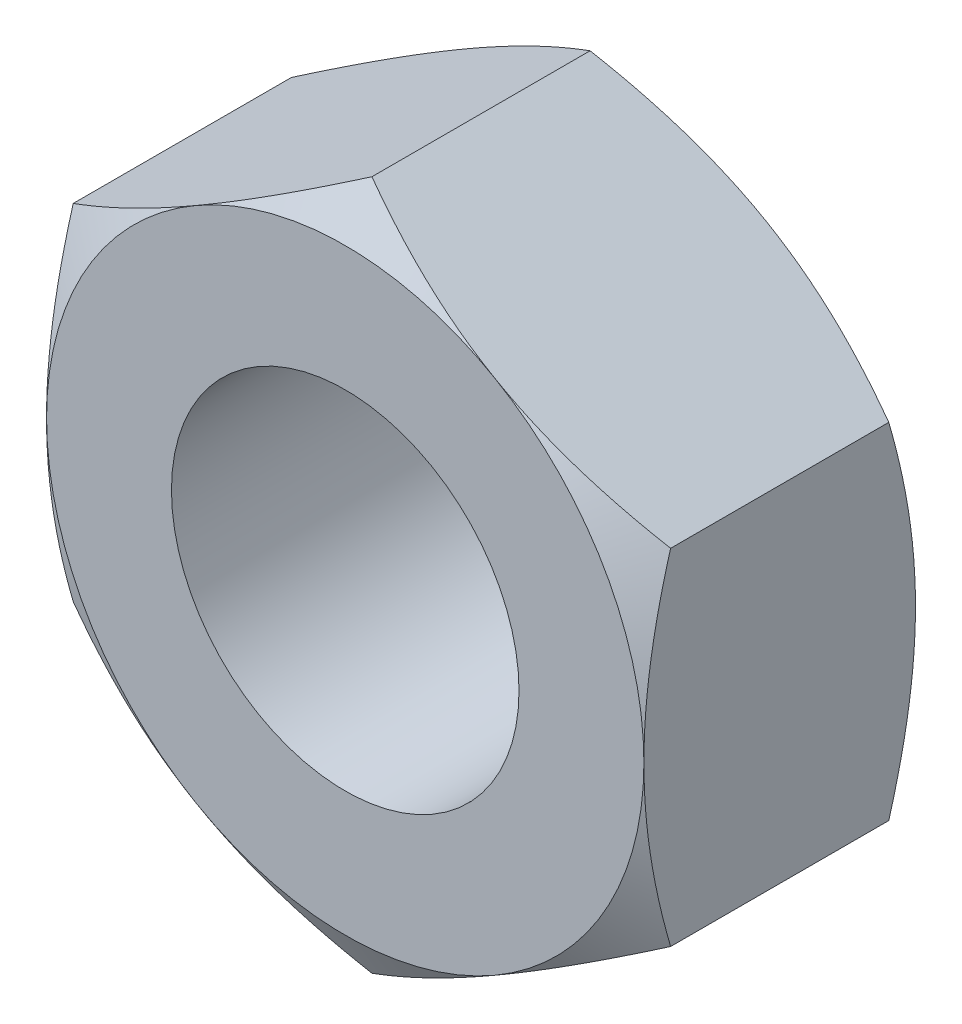
ISO-10303-21;
HEADER;
FILE_DESCRIPTION(('STEP AP214'),'2;1');
FILE_NAME('part.step','',(''),(''),'','','');
FILE_SCHEMA(('AUTOMOTIVE_DESIGN { 1 0 10303 214 1 1 1 1 }'));
ENDSEC;
DATA;
#1=APPLICATION_CONTEXT('core data for automotive mechanical design processes');
#2=APPLICATION_PROTOCOL_DEFINITION('international standard','automotive_design',2000,#1);
#3=PRODUCT_CONTEXT('',#1,'mechanical');
#4=PRODUCT('Part','Part','',(#3));
#5=PRODUCT_RELATED_PRODUCT_CATEGORY('part','',(#4));
#6=PRODUCT_DEFINITION_FORMATION('','',#4);
#7=PRODUCT_DEFINITION_CONTEXT('part definition',#1,'design');
#8=PRODUCT_DEFINITION('design','',#6,#7);
#9=PRODUCT_DEFINITION_SHAPE('','',#8);
#10=(LENGTH_UNIT() NAMED_UNIT(*) SI_UNIT(.MILLI.,.METRE.));
#11=(NAMED_UNIT(*) PLANE_ANGLE_UNIT() SI_UNIT($,.RADIAN.));
#12=(NAMED_UNIT(*) SI_UNIT($,.STERADIAN.) SOLID_ANGLE_UNIT());
#13=UNCERTAINTY_MEASURE_WITH_UNIT(LENGTH_MEASURE(1.E-05),#10,'distance_accuracy_value','');
#14=(GEOMETRIC_REPRESENTATION_CONTEXT(3) GLOBAL_UNCERTAINTY_ASSIGNED_CONTEXT((#13)) GLOBAL_UNIT_ASSIGNED_CONTEXT((#10,
#11,#12)) REPRESENTATION_CONTEXT('',''));
#15=CARTESIAN_POINT('',(0.,0.,0.));
#16=DIRECTION('',(0.,0.,1.));
#17=DIRECTION('',(1.,0.,0.));
#18=AXIS2_PLACEMENT_3D('',#15,#16,#17);
#19=CARTESIAN_POINT('',(0.,0.,0.));
#20=DIRECTION('',(0.,0.,1.));
#21=DIRECTION('',(1.,0.,0.));
#22=AXIS2_PLACEMENT_3D('',#19,#20,#21);
#23=PLANE('',#22);
#24=CARTESIAN_POINT('',(0.,0.,0.));
#25=DIRECTION('',(0.,0.,1.));
#26=DIRECTION('',(1.,0.,0.));
#27=AXIS2_PLACEMENT_3D('',#24,#25,#26);
#28=CIRCLE('',#27,1.6);
#29=CARTESIAN_POINT('',(1.6,0.,0.));
#30=VERTEX_POINT('',#29);
#31=EDGE_CURVE('E445',#30,#30,#28,.T.);
#32=ORIENTED_EDGE('',*,*,#31,.T.);
#33=EDGE_LOOP('',(#32));
#34=FACE_BOUND('',#33,.T.);
#35=CARTESIAN_POINT('',(0.,0.,0.));
#36=DIRECTION('',(0.,0.,-1.));
#37=DIRECTION('',(-1.,0.,0.));
#38=AXIS2_PLACEMENT_3D('',#35,#36,#37);
#39=CIRCLE('',#38,2.75);
#40=CARTESIAN_POINT('',(2.75,0.,0.));
#41=VERTEX_POINT('',#40);
#42=CARTESIAN_POINT('',(1.375,-2.38156986040721,0.));
#43=VERTEX_POINT('',#42);
#44=EDGE_CURVE('E169',#41,#43,#39,.T.);
#45=ORIENTED_EDGE('',*,*,#44,.T.);
#46=CARTESIAN_POINT('',(0.,0.,0.));
#47=DIRECTION('',(0.,0.,-1.));
#48=DIRECTION('',(-1.,0.,0.));
#49=AXIS2_PLACEMENT_3D('',#46,#47,#48);
#50=CIRCLE('',#49,2.75);
#51=CARTESIAN_POINT('',(-1.375,-2.38156986040721,0.));
#52=VERTEX_POINT('',#51);
#53=EDGE_CURVE('E171',#43,#52,#50,.T.);
#54=ORIENTED_EDGE('',*,*,#53,.T.);
#55=CARTESIAN_POINT('',(0.,0.,0.));
#56=DIRECTION('',(0.,0.,-1.));
#57=DIRECTION('',(-1.,0.,0.));
#58=AXIS2_PLACEMENT_3D('',#55,#56,#57);
#59=CIRCLE('',#58,2.75);
#60=CARTESIAN_POINT('',(-2.75,0.,0.));
#61=VERTEX_POINT('',#60);
#62=EDGE_CURVE('E56',#52,#61,#59,.T.);
#63=ORIENTED_EDGE('',*,*,#62,.T.);
#64=CARTESIAN_POINT('',(0.,0.,0.));
#65=DIRECTION('',(0.,0.,-1.));
#66=DIRECTION('',(-1.,0.,0.));
#67=AXIS2_PLACEMENT_3D('',#64,#65,#66);
#68=CIRCLE('',#67,2.75);
#69=CARTESIAN_POINT('',(-1.375,2.38156986040721,0.));
#70=VERTEX_POINT('',#69);
#71=EDGE_CURVE('E250',#61,#70,#68,.T.);
#72=ORIENTED_EDGE('',*,*,#71,.T.);
#73=CARTESIAN_POINT('',(0.,0.,0.));
#74=DIRECTION('',(0.,0.,-1.));
#75=DIRECTION('',(-1.,0.,0.));
#76=AXIS2_PLACEMENT_3D('',#73,#74,#75);
#77=CIRCLE('',#76,2.75);
#78=CARTESIAN_POINT('',(1.375,2.38156986040721,0.));
#79=VERTEX_POINT('',#78);
#80=EDGE_CURVE('E244',#70,#79,#77,.T.);
#81=ORIENTED_EDGE('',*,*,#80,.T.);
#82=CARTESIAN_POINT('',(0.,0.,0.));
#83=DIRECTION('',(0.,0.,-1.));
#84=DIRECTION('',(-1.,0.,0.));
#85=AXIS2_PLACEMENT_3D('',#82,#83,#84);
#86=CIRCLE('',#85,2.75);
#87=EDGE_CURVE('E173',#79,#41,#86,.T.);
#88=ORIENTED_EDGE('',*,*,#87,.T.);
#89=EDGE_LOOP('',(#45,#54,#63,#72,#81,#88));
#90=FACE_BOUND('',#89,.T.);
#91=ADVANCED_FACE('F53',(#34,#90),#23,.F.);
#92=CARTESIAN_POINT('',(2.75,1.58771324027147,0.));
#93=DIRECTION('',(0.5,0.866025403784439,0.));
#94=DIRECTION('',(0.,0.,-1.));
#95=AXIS2_PLACEMENT_3D('',#92,#93,#94);
#96=PLANE('',#95);
#97=DIRECTION('',(0.,0.,-1.));
#98=VECTOR('',#97,1.);
#99=CARTESIAN_POINT('',(2.75,1.58771324027147,2.5));
#100=LINE('',#99,#98);
#101=CARTESIAN_POINT('',(2.75,1.58771324027147,2.25437990693814));
#102=VERTEX_POINT('',#101);
#103=CARTESIAN_POINT('',(2.75,1.58771324027147,0.245620093061863));
#104=VERTEX_POINT('',#103);
#105=EDGE_CURVE('E207',#102,#104,#100,.T.);
#106=ORIENTED_EDGE('',*,*,#105,.T.);
#107=CARTESIAN_POINT('',(2.75,1.58771324027147,0.245620093061863));
#108=CARTESIAN_POINT('',(2.01313972081441,2.01313972081441,0.));
#109=CARTESIAN_POINT('',(1.375,2.38156986040721,0.));
#110=(BOUNDED_CURVE() B_SPLINE_CURVE(2,(#107,#108,#109),.UNSPECIFIED.,.F.,
.F.) B_SPLINE_CURVE_WITH_KNOTS((3,3),(0.0761014663262321,0.248735310295511),
.UNSPECIFIED.) CURVE() GEOMETRIC_REPRESENTATION_ITEM() RATIONAL_B_SPLINE_CURVE((1.03390088978584,
1.05540200962769,1.)) REPRESENTATION_ITEM(''));
#111=EDGE_CURVE('E231',#104,#79,#110,.T.);
#112=ORIENTED_EDGE('',*,*,#111,.T.);
#113=CARTESIAN_POINT('',(1.375,2.38156986040721,0.));
#114=CARTESIAN_POINT('',(0.736860279185589,2.75,0.));
#115=CARTESIAN_POINT('',(0.,3.17542648054294,0.245620093061863));
#116=(BOUNDED_CURVE() B_SPLINE_CURVE(2,(#113,#114,#115),.UNSPECIFIED.,.F.,
.F.) B_SPLINE_CURVE_WITH_KNOTS((3,3),(0.248735310295511,0.42136915426479),
.UNSPECIFIED.) CURVE() GEOMETRIC_REPRESENTATION_ITEM() RATIONAL_B_SPLINE_CURVE((1.,
1.05540200962769,1.03390088978584)) REPRESENTATION_ITEM(''));
#117=CARTESIAN_POINT('',(0.,3.17542648054294,0.245620093061863));
#118=VERTEX_POINT('',#117);
#119=EDGE_CURVE('E243',#79,#118,#116,.T.);
#120=ORIENTED_EDGE('',*,*,#119,.T.);
#121=DIRECTION('',(0.,0.,1.));
#122=VECTOR('',#121,1.);
#123=CARTESIAN_POINT('',(0.,3.17542648054294,0.));
#124=LINE('',#123,#122);
#125=CARTESIAN_POINT('',(0.,3.17542648054294,2.25437990693814));
#126=VERTEX_POINT('',#125);
#127=EDGE_CURVE('E11',#118,#126,#124,.T.);
#128=ORIENTED_EDGE('',*,*,#127,.T.);
#129=CARTESIAN_POINT('',(1.375,2.38156986040721,2.5));
#130=CARTESIAN_POINT('',(0.736860279185589,2.75,2.5));
#131=CARTESIAN_POINT('',(0.,3.17542648054294,2.25437990693814));
#132=(BOUNDED_CURVE() B_SPLINE_CURVE(2,(#129,#130,#131),.UNSPECIFIED.,.F.,
.F.) B_SPLINE_CURVE_WITH_KNOTS((3,3),(0.248735310295511,0.42136915426479),
.UNSPECIFIED.) CURVE() GEOMETRIC_REPRESENTATION_ITEM() RATIONAL_B_SPLINE_CURVE((1.,
1.05540200962769,1.03390088978584)) REPRESENTATION_ITEM(''));
#133=CARTESIAN_POINT('',(1.375,2.38156986040721,2.5));
#134=VERTEX_POINT('',#133);
#135=EDGE_CURVE('E286',#134,#126,#132,.T.);
#136=ORIENTED_EDGE('',*,*,#135,.F.);
#137=CARTESIAN_POINT('',(2.75,1.58771324027147,2.25437990693814));
#138=CARTESIAN_POINT('',(2.01313972081441,2.01313972081441,2.5));
#139=CARTESIAN_POINT('',(1.375,2.38156986040721,2.5));
#140=(BOUNDED_CURVE() B_SPLINE_CURVE(2,(#137,#138,#139),.UNSPECIFIED.,.F.,
.F.) B_SPLINE_CURVE_WITH_KNOTS((3,3),(0.0761014663262321,0.248735310295511),
.UNSPECIFIED.) CURVE() GEOMETRIC_REPRESENTATION_ITEM() RATIONAL_B_SPLINE_CURVE((1.03390088978584,
1.05540200962769,1.)) REPRESENTATION_ITEM(''));
#141=EDGE_CURVE('E333',#102,#134,#140,.T.);
#142=ORIENTED_EDGE('',*,*,#141,.F.);
#143=EDGE_LOOP('',(#106,#112,#120,#128,#136,#142));
#144=FACE_BOUND('',#143,.T.);
#145=ADVANCED_FACE('F485',(#144),#96,.T.);
#146=CARTESIAN_POINT('',(0.,3.17542648054294,0.));
#147=DIRECTION('',(-0.5,0.866025403784439,0.));
#148=DIRECTION('',(0.,0.,1.));
#149=AXIS2_PLACEMENT_3D('',#146,#147,#148);
#150=PLANE('',#149);
#151=ORIENTED_EDGE('',*,*,#127,.F.);
#152=CARTESIAN_POINT('',(0.,3.17542648054294,0.245620093061863));
#153=CARTESIAN_POINT('',(-0.736860279185586,2.75,0.));
#154=CARTESIAN_POINT('',(-1.375,2.38156986040721,0.));
#155=(BOUNDED_CURVE() B_SPLINE_CURVE(2,(#152,#153,#154),.UNSPECIFIED.,.F.,
.F.) B_SPLINE_CURVE_WITH_KNOTS((3,3),(0.0761014663262319,0.248735310295511),
.UNSPECIFIED.) CURVE() GEOMETRIC_REPRESENTATION_ITEM() RATIONAL_B_SPLINE_CURVE((1.03390088978584,
1.05540200962769,1.)) REPRESENTATION_ITEM(''));
#156=EDGE_CURVE('E237',#118,#70,#155,.T.);
#157=ORIENTED_EDGE('',*,*,#156,.T.);
#158=CARTESIAN_POINT('',(-1.375,2.38156986040721,0.));
#159=CARTESIAN_POINT('',(-2.01313972081441,2.01313972081441,0.));
#160=CARTESIAN_POINT('',(-2.75,1.58771324027147,0.245620093061863));
#161=(BOUNDED_CURVE() B_SPLINE_CURVE(2,(#158,#159,#160),.UNSPECIFIED.,.F.,
.F.) B_SPLINE_CURVE_WITH_KNOTS((3,3),(0.248735310295511,0.42136915426479),
.UNSPECIFIED.) CURVE() GEOMETRIC_REPRESENTATION_ITEM() RATIONAL_B_SPLINE_CURVE((1.,
1.05540200962769,1.03390088978584)) REPRESENTATION_ITEM(''));
#162=CARTESIAN_POINT('',(-2.75,1.58771324027147,0.245620093061863));
#163=VERTEX_POINT('',#162);
#164=EDGE_CURVE('E253',#70,#163,#161,.T.);
#165=ORIENTED_EDGE('',*,*,#164,.T.);
#166=DIRECTION('',(0.,0.,1.));
#167=VECTOR('',#166,1.);
#168=CARTESIAN_POINT('',(-2.75,1.58771324027147,0.));
#169=LINE('',#168,#167);
#170=CARTESIAN_POINT('',(-2.75,1.58771324027147,2.25437990693814));
#171=VERTEX_POINT('',#170);
#172=EDGE_CURVE('E62',#163,#171,#169,.T.);
#173=ORIENTED_EDGE('',*,*,#172,.T.);
#174=CARTESIAN_POINT('',(-1.375,2.38156986040721,2.5));
#175=CARTESIAN_POINT('',(-2.01313972081441,2.01313972081441,2.5));
#176=CARTESIAN_POINT('',(-2.75,1.58771324027147,2.25437990693814));
#177=(BOUNDED_CURVE() B_SPLINE_CURVE(2,(#174,#175,#176),.UNSPECIFIED.,.F.,
.F.) B_SPLINE_CURVE_WITH_KNOTS((3,3),(0.248735310295511,0.42136915426479),
.UNSPECIFIED.) CURVE() GEOMETRIC_REPRESENTATION_ITEM() RATIONAL_B_SPLINE_CURVE((1.,
1.05540200962769,1.03390088978584)) REPRESENTATION_ITEM(''));
#178=CARTESIAN_POINT('',(-1.375,2.38156986040721,2.5));
#179=VERTEX_POINT('',#178);
#180=EDGE_CURVE('E326',#179,#171,#177,.T.);
#181=ORIENTED_EDGE('',*,*,#180,.F.);
#182=CARTESIAN_POINT('',(0.,3.17542648054294,2.25437990693814));
#183=CARTESIAN_POINT('',(-0.736860279185586,2.75,2.5));
#184=CARTESIAN_POINT('',(-1.375,2.38156986040721,2.5));
#185=(BOUNDED_CURVE() B_SPLINE_CURVE(2,(#182,#183,#184),.UNSPECIFIED.,.F.,
.F.) B_SPLINE_CURVE_WITH_KNOTS((3,3),(0.0761014663262319,0.248735310295511),
.UNSPECIFIED.) CURVE() GEOMETRIC_REPRESENTATION_ITEM() RATIONAL_B_SPLINE_CURVE((1.03390088978584,
1.05540200962769,1.)) REPRESENTATION_ITEM(''));
#186=EDGE_CURVE('E280',#126,#179,#185,.T.);
#187=ORIENTED_EDGE('',*,*,#186,.F.);
#188=EDGE_LOOP('',(#151,#157,#165,#173,#181,#187));
#189=FACE_BOUND('',#188,.T.);
#190=ADVANCED_FACE('F491',(#189),#150,.T.);
#191=CARTESIAN_POINT('',(-2.75,1.58771324027147,0.));
#192=DIRECTION('',(-1.,0.,0.));
#193=DIRECTION('',(0.,0.,1.));
#194=AXIS2_PLACEMENT_3D('',#191,#192,#193);
#195=PLANE('',#194);
#196=ORIENTED_EDGE('',*,*,#172,.F.);
#197=CARTESIAN_POINT('',(-2.75,1.58771324027147,0.245620093061863));
#198=CARTESIAN_POINT('',(-2.75,0.736860279185591,0.));
#199=CARTESIAN_POINT('',(-2.75,0.,0.));
#200=(BOUNDED_CURVE() B_SPLINE_CURVE(2,(#197,#198,#199),.UNSPECIFIED.,.F.,
.F.) B_SPLINE_CURVE_WITH_KNOTS((3,3),(0.076101466326232,0.248735310295511),
.UNSPECIFIED.) CURVE() GEOMETRIC_REPRESENTATION_ITEM() RATIONAL_B_SPLINE_CURVE((1.03390088978584,
1.05540200962769,1.)) REPRESENTATION_ITEM(''));
#201=EDGE_CURVE('E249',#163,#61,#200,.T.);
#202=ORIENTED_EDGE('',*,*,#201,.T.);
#203=CARTESIAN_POINT('',(-2.75,0.,0.));
#204=CARTESIAN_POINT('',(-2.75,-0.736860279185585,0.));
#205=CARTESIAN_POINT('',(-2.75,-1.58771324027147,0.245620093061863));
#206=(BOUNDED_CURVE() B_SPLINE_CURVE(2,(#203,#204,#205),.UNSPECIFIED.,.F.,
.F.) B_SPLINE_CURVE_WITH_KNOTS((3,3),(0.248735310295511,0.42136915426479),
.UNSPECIFIED.) CURVE() GEOMETRIC_REPRESENTATION_ITEM() RATIONAL_B_SPLINE_CURVE((1.,
1.05540200962769,1.03390088978584)) REPRESENTATION_ITEM(''));
#207=CARTESIAN_POINT('',(-2.75,-1.58771324027147,0.245620093061863));
#208=VERTEX_POINT('',#207);
#209=EDGE_CURVE('E252',#61,#208,#206,.T.);
#210=ORIENTED_EDGE('',*,*,#209,.T.);
#211=DIRECTION('',(0.,0.,1.));
#212=VECTOR('',#211,1.);
#213=CARTESIAN_POINT('',(-2.75,-1.58771324027147,0.));
#214=LINE('',#213,#212);
#215=CARTESIAN_POINT('',(-2.75,-1.58771324027147,2.25437990693814));
#216=VERTEX_POINT('',#215);
#217=EDGE_CURVE('E198',#208,#216,#214,.T.);
#218=ORIENTED_EDGE('',*,*,#217,.T.);
#219=CARTESIAN_POINT('',(-2.75,0.,2.5));
#220=CARTESIAN_POINT('',(-2.75,-0.736860279185585,2.5));
#221=CARTESIAN_POINT('',(-2.75,-1.58771324027147,2.25437990693814));
#222=(BOUNDED_CURVE() B_SPLINE_CURVE(2,(#219,#220,#221),.UNSPECIFIED.,.F.,
.F.) B_SPLINE_CURVE_WITH_KNOTS((3,3),(0.248735310295511,0.42136915426479),
.UNSPECIFIED.) CURVE() GEOMETRIC_REPRESENTATION_ITEM() RATIONAL_B_SPLINE_CURVE((1.,
1.05540200962769,1.03390088978584)) REPRESENTATION_ITEM(''));
#223=CARTESIAN_POINT('',(-2.75,0.,2.5));
#224=VERTEX_POINT('',#223);
#225=EDGE_CURVE('E371',#224,#216,#222,.T.);
#226=ORIENTED_EDGE('',*,*,#225,.F.);
#227=CARTESIAN_POINT('',(-2.75,1.58771324027147,2.25437990693814));
#228=CARTESIAN_POINT('',(-2.75,0.736860279185591,2.5));
#229=CARTESIAN_POINT('',(-2.75,0.,2.5));
#230=(BOUNDED_CURVE() B_SPLINE_CURVE(2,(#227,#228,#229),.UNSPECIFIED.,.F.,
.F.) B_SPLINE_CURVE_WITH_KNOTS((3,3),(0.076101466326232,0.248735310295511),
.UNSPECIFIED.) CURVE() GEOMETRIC_REPRESENTATION_ITEM() RATIONAL_B_SPLINE_CURVE((1.03390088978584,
1.05540200962769,1.)) REPRESENTATION_ITEM(''));
#231=EDGE_CURVE('E320',#171,#224,#230,.T.);
#232=ORIENTED_EDGE('',*,*,#231,.F.);
#233=EDGE_LOOP('',(#196,#202,#210,#218,#226,#232));
#234=FACE_BOUND('',#233,.T.);
#235=ADVANCED_FACE('F500',(#234),#195,.T.);
#236=CARTESIAN_POINT('',(0.,0.,0.263594173754417));
#237=DIRECTION('',(0.,0.,1.));
#238=DIRECTION('',(-1.,0.,0.));
#239=AXIS2_PLACEMENT_3D('',#236,#237,#238);
#240=CONICAL_SURFACE('',#239,3.20655850152179,1.0471975511966);
#241=CARTESIAN_POINT('',(1.375,-2.38156986040721,0.));
#242=CARTESIAN_POINT('',(2.01313972081441,-2.01313972081441,0.));
#243=CARTESIAN_POINT('',(2.75,-1.58771324027147,0.245620093061863));
#244=(BOUNDED_CURVE() B_SPLINE_CURVE(2,(#241,#242,#243),.UNSPECIFIED.,.F.,
.F.) B_SPLINE_CURVE_WITH_KNOTS((3,3),(0.248735310295511,0.421369154264791),
.UNSPECIFIED.) CURVE() GEOMETRIC_REPRESENTATION_ITEM() RATIONAL_B_SPLINE_CURVE((1.,
1.05540200962769,1.03390088978584)) REPRESENTATION_ITEM(''));
#245=CARTESIAN_POINT('',(2.75,-1.58771324027147,0.245620093061863));
#246=VERTEX_POINT('',#245);
#247=EDGE_CURVE('E191',#43,#246,#244,.T.);
#248=ORIENTED_EDGE('',*,*,#247,.F.);
#249=ORIENTED_EDGE('',*,*,#44,.F.);
#250=CARTESIAN_POINT('',(2.75,-1.58771324027147,0.245620093061863));
#251=CARTESIAN_POINT('',(2.75,-0.736860279185591,0.));
#252=CARTESIAN_POINT('',(2.75,0.,0.));
#253=(BOUNDED_CURVE() B_SPLINE_CURVE(2,(#250,#251,#252),.UNSPECIFIED.,.F.,
.F.) B_SPLINE_CURVE_WITH_KNOTS((3,3),(0.076101466326232,0.248735310295511),
.UNSPECIFIED.) CURVE() GEOMETRIC_REPRESENTATION_ITEM() RATIONAL_B_SPLINE_CURVE((1.03390088978584,
1.05540200962769,1.)) REPRESENTATION_ITEM(''));
#254=EDGE_CURVE('E194',#246,#41,#253,.T.);
#255=ORIENTED_EDGE('',*,*,#254,.F.);
#256=EDGE_LOOP('',(#248,#249,#255));
#257=FACE_BOUND('',#256,.T.);
#258=ADVANCED_FACE('F192',(#257),#240,.T.);
#259=CARTESIAN_POINT('',(0.,0.,0.263594173754417));
#260=DIRECTION('',(0.,0.,1.));
#261=DIRECTION('',(-1.,0.,0.));
#262=AXIS2_PLACEMENT_3D('',#259,#260,#261);
#263=CONICAL_SURFACE('',#262,3.20655850152179,1.0471975511966);
#264=CARTESIAN_POINT('',(-1.375,-2.38156986040721,0.));
#265=CARTESIAN_POINT('',(-0.736860279185591,-2.75,0.));
#266=CARTESIAN_POINT('',(0.,-3.17542648054294,0.245620093061863));
#267=(BOUNDED_CURVE() B_SPLINE_CURVE(2,(#264,#265,#266),.UNSPECIFIED.,.F.,
.F.) B_SPLINE_CURVE_WITH_KNOTS((3,3),(0.248735310295511,0.42136915426479),
.UNSPECIFIED.) CURVE() GEOMETRIC_REPRESENTATION_ITEM() RATIONAL_B_SPLINE_CURVE((1.,
1.05540200962769,1.03390088978584)) REPRESENTATION_ITEM(''));
#268=CARTESIAN_POINT('',(0.,-3.17542648054294,0.245620093061863));
#269=VERTEX_POINT('',#268);
#270=EDGE_CURVE('E187',#52,#269,#267,.T.);
#271=ORIENTED_EDGE('',*,*,#270,.F.);
#272=ORIENTED_EDGE('',*,*,#53,.F.);
#273=CARTESIAN_POINT('',(0.,-3.17542648054294,0.245620093061863));
#274=CARTESIAN_POINT('',(0.736860279185585,-2.75,0.));
#275=CARTESIAN_POINT('',(1.375,-2.38156986040721,0.));
#276=(BOUNDED_CURVE() B_SPLINE_CURVE(2,(#273,#274,#275),.UNSPECIFIED.,.F.,
.F.) B_SPLINE_CURVE_WITH_KNOTS((3,3),(0.076101466326232,0.248735310295511),
.UNSPECIFIED.) CURVE() GEOMETRIC_REPRESENTATION_ITEM() RATIONAL_B_SPLINE_CURVE((1.03390088978584,
1.05540200962769,1.)) REPRESENTATION_ITEM(''));
#277=EDGE_CURVE('E185',#269,#43,#276,.T.);
#278=ORIENTED_EDGE('',*,*,#277,.F.);
#279=EDGE_LOOP('',(#271,#272,#278));
#280=FACE_BOUND('',#279,.T.);
#281=ADVANCED_FACE('F183',(#280),#263,.T.);
#282=CARTESIAN_POINT('',(0.,0.,0.263594173754417));
#283=DIRECTION('',(0.,0.,1.));
#284=DIRECTION('',(-1.,0.,0.));
#285=AXIS2_PLACEMENT_3D('',#282,#283,#284);
#286=CONICAL_SURFACE('',#285,3.20655850152179,1.0471975511966);
#287=ORIENTED_EDGE('',*,*,#209,.F.);
#288=ORIENTED_EDGE('',*,*,#62,.F.);
#289=CARTESIAN_POINT('',(-2.75,-1.58771324027147,0.245620093061863));
#290=CARTESIAN_POINT('',(-2.01313972081441,-2.01313972081441,0.));
#291=CARTESIAN_POINT('',(-1.375,-2.38156986040721,0.));
#292=(BOUNDED_CURVE() B_SPLINE_CURVE(2,(#289,#290,#291),.UNSPECIFIED.,.F.,
.F.) B_SPLINE_CURVE_WITH_KNOTS((3,3),(0.0761014663262319,0.248735310295511),
.UNSPECIFIED.) CURVE() GEOMETRIC_REPRESENTATION_ITEM() RATIONAL_B_SPLINE_CURVE((1.03390088978584,
1.05540200962769,1.)) REPRESENTATION_ITEM(''));
#293=EDGE_CURVE('E219',#208,#52,#292,.T.);
#294=ORIENTED_EDGE('',*,*,#293,.F.);
#295=EDGE_LOOP('',(#287,#288,#294));
#296=FACE_BOUND('',#295,.T.);
#297=ADVANCED_FACE('F507',(#296),#286,.T.);
#298=CARTESIAN_POINT('',(0.,0.,0.263594173754417));
#299=DIRECTION('',(0.,0.,1.));
#300=DIRECTION('',(-1.,0.,0.));
#301=AXIS2_PLACEMENT_3D('',#298,#299,#300);
#302=CONICAL_SURFACE('',#301,3.20655850152179,1.0471975511966);
#303=ORIENTED_EDGE('',*,*,#201,.F.);
#304=ORIENTED_EDGE('',*,*,#164,.F.);
#305=ORIENTED_EDGE('',*,*,#71,.F.);
#306=EDGE_LOOP('',(#303,#304,#305));
#307=FACE_BOUND('',#306,.T.);
#308=ADVANCED_FACE('F508',(#307),#302,.T.);
#309=CARTESIAN_POINT('',(0.,0.,0.263594173754417));
#310=DIRECTION('',(0.,0.,1.));
#311=DIRECTION('',(-1.,0.,0.));
#312=AXIS2_PLACEMENT_3D('',#309,#310,#311);
#313=CONICAL_SURFACE('',#312,3.20655850152179,1.0471975511966);
#314=ORIENTED_EDGE('',*,*,#156,.F.);
#315=ORIENTED_EDGE('',*,*,#119,.F.);
#316=ORIENTED_EDGE('',*,*,#80,.F.);
#317=EDGE_LOOP('',(#314,#315,#316));
#318=FACE_BOUND('',#317,.T.);
#319=ADVANCED_FACE('F511',(#318),#313,.T.);
#320=CARTESIAN_POINT('',(0.,0.,0.263594173754417));
#321=DIRECTION('',(0.,0.,1.));
#322=DIRECTION('',(-1.,0.,0.));
#323=AXIS2_PLACEMENT_3D('',#320,#321,#322);
#324=CONICAL_SURFACE('',#323,3.20655850152179,1.0471975511966);
#325=ORIENTED_EDGE('',*,*,#111,.F.);
#326=CARTESIAN_POINT('',(2.75,0.,0.));
#327=CARTESIAN_POINT('',(2.75,0.736860279185587,0.));
#328=CARTESIAN_POINT('',(2.75,1.58771324027147,0.245620093061863));
#329=(BOUNDED_CURVE() B_SPLINE_CURVE(2,(#326,#327,#328),.UNSPECIFIED.,.F.,
.F.) B_SPLINE_CURVE_WITH_KNOTS((3,3),(0.248735310295511,0.42136915426479),
.UNSPECIFIED.) CURVE() GEOMETRIC_REPRESENTATION_ITEM() RATIONAL_B_SPLINE_CURVE((1.,
1.05540200962769,1.03390088978584)) REPRESENTATION_ITEM(''));
#330=EDGE_CURVE('E279',#41,#104,#329,.T.);
#331=ORIENTED_EDGE('',*,*,#330,.F.);
#332=ORIENTED_EDGE('',*,*,#87,.F.);
#333=EDGE_LOOP('',(#325,#331,#332));
#334=FACE_BOUND('',#333,.T.);
#335=ADVANCED_FACE('F515',(#334),#324,.T.);
#336=CARTESIAN_POINT('',(-2.75,-1.58771324027147,0.));
#337=DIRECTION('',(-0.5,-0.866025403784438,0.));
#338=DIRECTION('',(-0.866025403784438,0.5,0.));
#339=AXIS2_PLACEMENT_3D('',#336,#337,#338);
#340=PLANE('',#339);
#341=ORIENTED_EDGE('',*,*,#217,.F.);
#342=ORIENTED_EDGE('',*,*,#293,.T.);
#343=ORIENTED_EDGE('',*,*,#270,.T.);
#344=DIRECTION('',(0.,0.,1.));
#345=VECTOR('',#344,1.);
#346=CARTESIAN_POINT('',(0.,-3.17542648054294,0.));
#347=LINE('',#346,#345);
#348=CARTESIAN_POINT('',(0.,-3.17542648054294,2.25437990693814));
#349=VERTEX_POINT('',#348);
#350=EDGE_CURVE('E202',#269,#349,#347,.T.);
#351=ORIENTED_EDGE('',*,*,#350,.T.);
#352=CARTESIAN_POINT('',(-1.375,-2.38156986040721,2.5));
#353=CARTESIAN_POINT('',(-0.736860279185591,-2.75,2.5));
#354=CARTESIAN_POINT('',(0.,-3.17542648054294,2.25437990693814));
#355=(BOUNDED_CURVE() B_SPLINE_CURVE(2,(#352,#353,#354),.UNSPECIFIED.,.F.,
.F.) B_SPLINE_CURVE_WITH_KNOTS((3,3),(0.248735310295511,0.42136915426479),
.UNSPECIFIED.) CURVE() GEOMETRIC_REPRESENTATION_ITEM() RATIONAL_B_SPLINE_CURVE((1.,
1.05540200962769,1.03390088978584)) REPRESENTATION_ITEM(''));
#356=CARTESIAN_POINT('',(-1.375,-2.38156986040721,2.5));
#357=VERTEX_POINT('',#356);
#358=EDGE_CURVE('E297',#357,#349,#355,.T.);
#359=ORIENTED_EDGE('',*,*,#358,.F.);
#360=CARTESIAN_POINT('',(-2.75,-1.58771324027147,2.25437990693814));
#361=CARTESIAN_POINT('',(-2.01313972081441,-2.01313972081441,2.5));
#362=CARTESIAN_POINT('',(-1.375,-2.38156986040721,2.5));
#363=(BOUNDED_CURVE() B_SPLINE_CURVE(2,(#360,#361,#362),.UNSPECIFIED.,.F.,
.F.) B_SPLINE_CURVE_WITH_KNOTS((3,3),(0.0761014663262319,0.248735310295511),
.UNSPECIFIED.) CURVE() GEOMETRIC_REPRESENTATION_ITEM() RATIONAL_B_SPLINE_CURVE((1.03390088978584,
1.05540200962769,1.)) REPRESENTATION_ITEM(''));
#364=EDGE_CURVE('E382',#216,#357,#363,.T.);
#365=ORIENTED_EDGE('',*,*,#364,.F.);
#366=EDGE_LOOP('',(#341,#342,#343,#351,#359,#365));
#367=FACE_BOUND('',#366,.T.);
#368=ADVANCED_FACE('F519',(#367),#340,.T.);
#369=CARTESIAN_POINT('',(0.,-3.17542648054294,0.));
#370=DIRECTION('',(0.5,-0.866025403784439,0.));
#371=DIRECTION('',(0.,0.,-1.));
#372=AXIS2_PLACEMENT_3D('',#369,#370,#371);
#373=PLANE('',#372);
#374=ORIENTED_EDGE('',*,*,#350,.F.);
#375=ORIENTED_EDGE('',*,*,#277,.T.);
#376=ORIENTED_EDGE('',*,*,#247,.T.);
#377=DIRECTION('',(0.,0.,1.));
#378=VECTOR('',#377,1.);
#379=CARTESIAN_POINT('',(2.75,-1.58771324027147,0.));
#380=LINE('',#379,#378);
#381=CARTESIAN_POINT('',(2.75,-1.58771324027147,2.25437990693814));
#382=VERTEX_POINT('',#381);
#383=EDGE_CURVE('E398',#246,#382,#380,.T.);
#384=ORIENTED_EDGE('',*,*,#383,.T.);
#385=CARTESIAN_POINT('',(1.375,-2.38156986040721,2.5));
#386=CARTESIAN_POINT('',(2.01313972081441,-2.01313972081441,2.5));
#387=CARTESIAN_POINT('',(2.75,-1.58771324027147,2.25437990693814));
#388=(BOUNDED_CURVE() B_SPLINE_CURVE(2,(#385,#386,#387),.UNSPECIFIED.,.F.,
.F.) B_SPLINE_CURVE_WITH_KNOTS((3,3),(0.248735310295511,0.421369154264791),
.UNSPECIFIED.) CURVE() GEOMETRIC_REPRESENTATION_ITEM() RATIONAL_B_SPLINE_CURVE((1.,
1.05540200962769,1.03390088978584)) REPRESENTATION_ITEM(''));
#389=CARTESIAN_POINT('',(1.375,-2.38156986040721,2.5));
#390=VERTEX_POINT('',#389);
#391=EDGE_CURVE('E296',#390,#382,#388,.T.);
#392=ORIENTED_EDGE('',*,*,#391,.F.);
#393=CARTESIAN_POINT('',(0.,-3.17542648054294,2.25437990693814));
#394=CARTESIAN_POINT('',(0.736860279185585,-2.75,2.5));
#395=CARTESIAN_POINT('',(1.375,-2.38156986040721,2.5));
#396=(BOUNDED_CURVE() B_SPLINE_CURVE(2,(#393,#394,#395),.UNSPECIFIED.,.F.,
.F.) B_SPLINE_CURVE_WITH_KNOTS((3,3),(0.076101466326232,0.248735310295511),
.UNSPECIFIED.) CURVE() GEOMETRIC_REPRESENTATION_ITEM() RATIONAL_B_SPLINE_CURVE((1.03390088978584,
1.05540200962769,1.)) REPRESENTATION_ITEM(''));
#397=EDGE_CURVE('E288',#349,#390,#396,.T.);
#398=ORIENTED_EDGE('',*,*,#397,.F.);
#399=EDGE_LOOP('',(#374,#375,#376,#384,#392,#398));
#400=FACE_BOUND('',#399,.T.);
#401=ADVANCED_FACE('F200',(#400),#373,.T.);
#402=CARTESIAN_POINT('',(2.75,-1.58771324027147,0.));
#403=DIRECTION('',(1.,0.,0.));
#404=DIRECTION('',(0.,-1.,0.));
#405=AXIS2_PLACEMENT_3D('',#402,#403,#404);
#406=PLANE('',#405);
#407=ORIENTED_EDGE('',*,*,#383,.F.);
#408=ORIENTED_EDGE('',*,*,#254,.T.);
#409=ORIENTED_EDGE('',*,*,#330,.T.);
#410=ORIENTED_EDGE('',*,*,#105,.F.);
#411=CARTESIAN_POINT('',(2.75,0.,2.5));
#412=CARTESIAN_POINT('',(2.75,0.736860279185587,2.5));
#413=CARTESIAN_POINT('',(2.75,1.58771324027147,2.25437990693814));
#414=(BOUNDED_CURVE() B_SPLINE_CURVE(2,(#411,#412,#413),.UNSPECIFIED.,.F.,
.F.) B_SPLINE_CURVE_WITH_KNOTS((3,3),(0.248735310295511,0.42136915426479),
.UNSPECIFIED.) CURVE() GEOMETRIC_REPRESENTATION_ITEM() RATIONAL_B_SPLINE_CURVE((1.,
1.05540200962769,1.03390088978584)) REPRESENTATION_ITEM(''));
#415=CARTESIAN_POINT('',(2.75,0.,2.5));
#416=VERTEX_POINT('',#415);
#417=EDGE_CURVE('E287',#416,#102,#414,.T.);
#418=ORIENTED_EDGE('',*,*,#417,.F.);
#419=CARTESIAN_POINT('',(2.75,-1.58771324027147,2.25437990693814));
#420=CARTESIAN_POINT('',(2.75,-0.736860279185591,2.5));
#421=CARTESIAN_POINT('',(2.75,0.,2.5));
#422=(BOUNDED_CURVE() B_SPLINE_CURVE(2,(#419,#420,#421),.UNSPECIFIED.,.F.,
.F.) B_SPLINE_CURVE_WITH_KNOTS((3,3),(0.076101466326232,0.248735310295511),
.UNSPECIFIED.) CURVE() GEOMETRIC_REPRESENTATION_ITEM() RATIONAL_B_SPLINE_CURVE((1.03390088978584,
1.05540200962769,1.)) REPRESENTATION_ITEM(''));
#423=EDGE_CURVE('E420',#382,#416,#422,.T.);
#424=ORIENTED_EDGE('',*,*,#423,.F.);
#425=EDGE_LOOP('',(#407,#408,#409,#410,#418,#424));
#426=FACE_BOUND('',#425,.T.);
#427=ADVANCED_FACE('F436',(#426),#406,.T.);
#428=CARTESIAN_POINT('',(0.,0.,2.23640582624558));
#429=DIRECTION('',(0.,0.,-1.));
#430=DIRECTION('',(-1.,0.,0.));
#431=AXIS2_PLACEMENT_3D('',#428,#429,#430);
#432=CONICAL_SURFACE('',#431,3.20655850152179,1.0471975511966);
#433=ORIENTED_EDGE('',*,*,#391,.T.);
#434=ORIENTED_EDGE('',*,*,#423,.T.);
#435=CARTESIAN_POINT('',(0.,0.,2.5));
#436=DIRECTION('',(0.,0.,-1.));
#437=DIRECTION('',(-1.,0.,0.));
#438=AXIS2_PLACEMENT_3D('',#435,#436,#437);
#439=CIRCLE('',#438,2.75);
#440=EDGE_CURVE('E307',#416,#390,#439,.T.);
#441=ORIENTED_EDGE('',*,*,#440,.T.);
#442=EDGE_LOOP('',(#433,#434,#441));
#443=FACE_BOUND('',#442,.T.);
#444=ADVANCED_FACE('F439',(#443),#432,.T.);
#445=CARTESIAN_POINT('',(0.,0.,2.23640582624558));
#446=DIRECTION('',(0.,0.,-1.));
#447=DIRECTION('',(-1.,0.,0.));
#448=AXIS2_PLACEMENT_3D('',#445,#446,#447);
#449=CONICAL_SURFACE('',#448,3.20655850152179,1.0471975511966);
#450=ORIENTED_EDGE('',*,*,#358,.T.);
#451=ORIENTED_EDGE('',*,*,#397,.T.);
#452=CARTESIAN_POINT('',(0.,0.,2.5));
#453=DIRECTION('',(0.,0.,-1.));
#454=DIRECTION('',(-1.,0.,0.));
#455=AXIS2_PLACEMENT_3D('',#452,#453,#454);
#456=CIRCLE('',#455,2.75);
#457=EDGE_CURVE('E319',#390,#357,#456,.T.);
#458=ORIENTED_EDGE('',*,*,#457,.T.);
#459=EDGE_LOOP('',(#450,#451,#458));
#460=FACE_BOUND('',#459,.T.);
#461=ADVANCED_FACE('F532',(#460),#449,.T.);
#462=CARTESIAN_POINT('',(0.,0.,2.23640582624558));
#463=DIRECTION('',(0.,0.,-1.));
#464=DIRECTION('',(-1.,0.,0.));
#465=AXIS2_PLACEMENT_3D('',#462,#463,#464);
#466=CONICAL_SURFACE('',#465,3.20655850152179,1.0471975511966);
#467=ORIENTED_EDGE('',*,*,#225,.T.);
#468=ORIENTED_EDGE('',*,*,#364,.T.);
#469=CARTESIAN_POINT('',(0.,0.,2.5));
#470=DIRECTION('',(0.,0.,-1.));
#471=DIRECTION('',(-1.,0.,0.));
#472=AXIS2_PLACEMENT_3D('',#469,#470,#471);
#473=CIRCLE('',#472,2.75);
#474=EDGE_CURVE('E315',#357,#224,#473,.T.);
#475=ORIENTED_EDGE('',*,*,#474,.T.);
#476=EDGE_LOOP('',(#467,#468,#475));
#477=FACE_BOUND('',#476,.T.);
#478=ADVANCED_FACE('F535',(#477),#466,.T.);
#479=CARTESIAN_POINT('',(0.,0.,2.23640582624558));
#480=DIRECTION('',(0.,0.,-1.));
#481=DIRECTION('',(-1.,0.,0.));
#482=AXIS2_PLACEMENT_3D('',#479,#480,#481);
#483=CONICAL_SURFACE('',#482,3.20655850152179,1.0471975511966);
#484=ORIENTED_EDGE('',*,*,#231,.T.);
#485=CARTESIAN_POINT('',(0.,0.,2.5));
#486=DIRECTION('',(0.,0.,-1.));
#487=DIRECTION('',(-1.,0.,0.));
#488=AXIS2_PLACEMENT_3D('',#485,#486,#487);
#489=CIRCLE('',#488,2.75);
#490=EDGE_CURVE('E311',#224,#179,#489,.T.);
#491=ORIENTED_EDGE('',*,*,#490,.T.);
#492=ORIENTED_EDGE('',*,*,#180,.T.);
#493=EDGE_LOOP('',(#484,#491,#492));
#494=FACE_BOUND('',#493,.T.);
#495=ADVANCED_FACE('F539',(#494),#483,.T.);
#496=CARTESIAN_POINT('',(0.,0.,2.23640582624558));
#497=DIRECTION('',(0.,0.,-1.));
#498=DIRECTION('',(-1.,0.,0.));
#499=AXIS2_PLACEMENT_3D('',#496,#497,#498);
#500=CONICAL_SURFACE('',#499,3.20655850152179,1.0471975511966);
#501=ORIENTED_EDGE('',*,*,#186,.T.);
#502=CARTESIAN_POINT('',(0.,0.,2.5));
#503=DIRECTION('',(0.,0.,-1.));
#504=DIRECTION('',(-1.,0.,0.));
#505=AXIS2_PLACEMENT_3D('',#502,#503,#504);
#506=CIRCLE('',#505,2.75);
#507=EDGE_CURVE('E306',#179,#134,#506,.T.);
#508=ORIENTED_EDGE('',*,*,#507,.T.);
#509=ORIENTED_EDGE('',*,*,#135,.T.);
#510=EDGE_LOOP('',(#501,#508,#509));
#511=FACE_BOUND('',#510,.T.);
#512=ADVANCED_FACE('F482',(#511),#500,.T.);
#513=CARTESIAN_POINT('',(0.,0.,2.23640582624558));
#514=DIRECTION('',(0.,0.,-1.));
#515=DIRECTION('',(-1.,0.,0.));
#516=AXIS2_PLACEMENT_3D('',#513,#514,#515);
#517=CONICAL_SURFACE('',#516,3.20655850152179,1.0471975511966);
#518=ORIENTED_EDGE('',*,*,#141,.T.);
#519=CARTESIAN_POINT('',(0.,0.,2.5));
#520=DIRECTION('',(0.,0.,-1.));
#521=DIRECTION('',(-1.,0.,0.));
#522=AXIS2_PLACEMENT_3D('',#519,#520,#521);
#523=CIRCLE('',#522,2.75);
#524=EDGE_CURVE('E302',#134,#416,#523,.T.);
#525=ORIENTED_EDGE('',*,*,#524,.T.);
#526=ORIENTED_EDGE('',*,*,#417,.T.);
#527=EDGE_LOOP('',(#518,#525,#526));
#528=FACE_BOUND('',#527,.T.);
#529=ADVANCED_FACE('F473',(#528),#517,.T.);
#530=CARTESIAN_POINT('',(0.,0.,2.5));
#531=DIRECTION('',(0.,0.,1.));
#532=DIRECTION('',(1.,0.,0.));
#533=AXIS2_PLACEMENT_3D('',#530,#531,#532);
#534=PLANE('',#533);
#535=CARTESIAN_POINT('',(0.,0.,2.5));
#536=DIRECTION('',(0.,0.,1.));
#537=DIRECTION('',(1.,0.,0.));
#538=AXIS2_PLACEMENT_3D('',#535,#536,#537);
#539=CIRCLE('',#538,1.6);
#540=CARTESIAN_POINT('',(1.6,0.,2.5));
#541=VERTEX_POINT('',#540);
#542=EDGE_CURVE('E449',#541,#541,#539,.T.);
#543=ORIENTED_EDGE('',*,*,#542,.F.);
#544=EDGE_LOOP('',(#543));
#545=FACE_BOUND('',#544,.T.);
#546=ORIENTED_EDGE('',*,*,#440,.F.);
#547=ORIENTED_EDGE('',*,*,#524,.F.);
#548=ORIENTED_EDGE('',*,*,#507,.F.);
#549=ORIENTED_EDGE('',*,*,#490,.F.);
#550=ORIENTED_EDGE('',*,*,#474,.F.);
#551=ORIENTED_EDGE('',*,*,#457,.F.);
#552=EDGE_LOOP('',(#546,#547,#548,#549,#550,#551));
#553=FACE_BOUND('',#552,.T.);
#554=ADVANCED_FACE('F471',(#545,#553),#534,.T.);
#555=CARTESIAN_POINT('',(0.,0.,0.));
#556=DIRECTION('',(0.,0.,1.));
#557=DIRECTION('',(1.,0.,0.));
#558=AXIS2_PLACEMENT_3D('',#555,#556,#557);
#559=CYLINDRICAL_SURFACE('',#558,1.6);
#560=ORIENTED_EDGE('',*,*,#31,.F.);
#561=EDGE_LOOP('',(#560));
#562=FACE_BOUND('',#561,.T.);
#563=ORIENTED_EDGE('',*,*,#542,.T.);
#564=EDGE_LOOP('',(#563));
#565=FACE_BOUND('',#564,.T.);
#566=ADVANCED_FACE('F469',(#562,#565),#559,.F.);
#567=CLOSED_SHELL('',(#91,#145,#190,#235,#258,#281,#297,#308,#319,#335,#368,#401,#427,#444,#461,
#478,#495,#512,#529,#554,#566));
#568=MANIFOLD_SOLID_BREP('B2',#567);
#569=ADVANCED_BREP_SHAPE_REPRESENTATION('',(#18,#568),#14);
#570=SHAPE_DEFINITION_REPRESENTATION(#9,#569);
ENDSEC;
END-ISO-10303-21;
